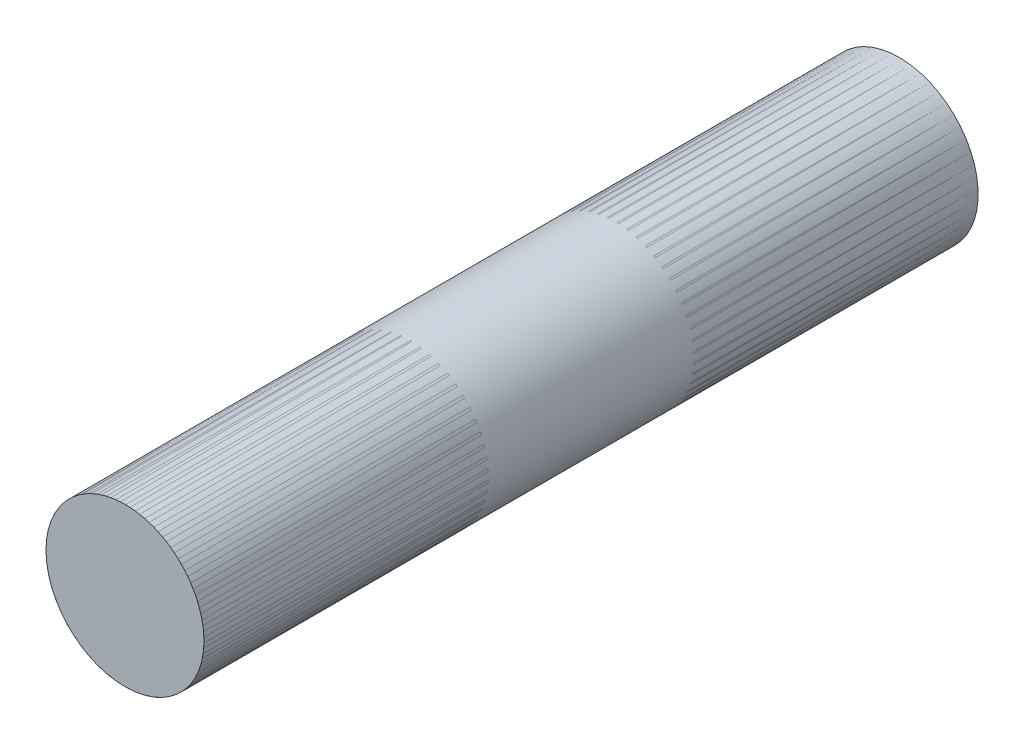
ISO-10303-21;
HEADER;
FILE_DESCRIPTION(('STEP AP214'),'2;1');
FILE_NAME('part.step','',(''),(''),'','','');
FILE_SCHEMA(('AUTOMOTIVE_DESIGN { 1 0 10303 214 1 1 1 1 }'));
ENDSEC;
DATA;
#1=APPLICATION_CONTEXT('core data for automotive mechanical design processes');
#2=APPLICATION_PROTOCOL_DEFINITION('international standard','automotive_design',2000,#1);
#3=PRODUCT_CONTEXT('',#1,'mechanical');
#4=PRODUCT('Part','Part','',(#3));
#5=PRODUCT_RELATED_PRODUCT_CATEGORY('part','',(#4));
#6=PRODUCT_DEFINITION_FORMATION('','',#4);
#7=PRODUCT_DEFINITION_CONTEXT('part definition',#1,'design');
#8=PRODUCT_DEFINITION('design','',#6,#7);
#9=PRODUCT_DEFINITION_SHAPE('','',#8);
#10=(LENGTH_UNIT() NAMED_UNIT(*) SI_UNIT(.MILLI.,.METRE.));
#11=(NAMED_UNIT(*) PLANE_ANGLE_UNIT() SI_UNIT($,.RADIAN.));
#12=(NAMED_UNIT(*) SI_UNIT($,.STERADIAN.) SOLID_ANGLE_UNIT());
#13=UNCERTAINTY_MEASURE_WITH_UNIT(LENGTH_MEASURE(1.E-05),#10,'distance_accuracy_value','');
#14=(GEOMETRIC_REPRESENTATION_CONTEXT(3) GLOBAL_UNCERTAINTY_ASSIGNED_CONTEXT((#13)) GLOBAL_UNIT_ASSIGNED_CONTEXT((#10,
#11,#12)) REPRESENTATION_CONTEXT('',''));
#15=CARTESIAN_POINT('',(0.,0.,0.));
#16=DIRECTION('',(0.,0.,1.));
#17=DIRECTION('',(1.,0.,0.));
#18=AXIS2_PLACEMENT_3D('',#15,#16,#17);
#19=CARTESIAN_POINT('',(0.,0.,39.37));
#20=DIRECTION('',(0.,0.,1.));
#21=DIRECTION('',(1.,0.,0.));
#22=AXIS2_PLACEMENT_3D('',#19,#20,#21);
#23=PLANE('',#22);
#24=CARTESIAN_POINT('',(0.,0.,39.37));
#25=DIRECTION('',(0.,0.,1.));
#26=DIRECTION('',(1.,0.,0.));
#27=AXIS2_PLACEMENT_3D('',#24,#25,#26);
#28=CIRCLE('',#27,6.35);
#29=CARTESIAN_POINT('',(6.34999999999997,0.,39.37));
#30=VERTEX_POINT('',#29);
#31=EDGE_CURVE('E11',#30,#30,#28,.F.);
#32=ORIENTED_EDGE('',*,*,#31,.F.);
#33=EDGE_LOOP('',(#32));
#34=FACE_BOUND('',#33,.T.);
#35=ADVANCED_FACE('F42',(#34),#23,.T.);
#36=CARTESIAN_POINT('',(0.,0.,-22.86));
#37=DIRECTION('',(0.,0.,-1.));
#38=DIRECTION('',(-1.,0.,0.));
#39=AXIS2_PLACEMENT_3D('',#36,#37,#38);
#40=PLANE('',#39);
#41=CARTESIAN_POINT('',(0.,0.,-22.86));
#42=DIRECTION('',(0.,0.,-1.));
#43=DIRECTION('',(-1.,0.,0.));
#44=AXIS2_PLACEMENT_3D('',#41,#42,#43);
#45=CIRCLE('',#44,6.35);
#46=CARTESIAN_POINT('',(-6.35,0.,-22.86));
#47=VERTEX_POINT('',#46);
#48=EDGE_CURVE('E48',#47,#47,#45,.T.);
#49=ORIENTED_EDGE('',*,*,#48,.T.);
#50=EDGE_LOOP('',(#49));
#51=FACE_BOUND('',#50,.T.);
#52=ADVANCED_FACE('F54',(#51),#40,.T.);
#53=CARTESIAN_POINT('',(0.,0.,57.3305122421383));
#54=DIRECTION('',(0.,0.,-1.));
#55=DIRECTION('',(-1.,0.,0.));
#56=AXIS2_PLACEMENT_3D('',#53,#54,#55);
#57=CYLINDRICAL_SURFACE('',#56,6.35);
#58=ORIENTED_EDGE('',*,*,#48,.F.);
#59=EDGE_LOOP('',(#58));
#60=FACE_BOUND('',#59,.T.);
#61=ORIENTED_EDGE('',*,*,#31,.T.);
#62=EDGE_LOOP('',(#61));
#63=FACE_BOUND('',#62,.T.);
#64=ADVANCED_FACE('F56',(#60,#63),#57,.T.);
#65=CLOSED_SHELL('',(#35,#52,#64));
#66=MANIFOLD_SOLID_BREP('B2',#65);
#67=CARTESIAN_POINT('',(1.04126776645508E-12,-5.48172618408671E-13,27.94));
#68=DIRECTION('',(0.,0.,1.));
#69=DIRECTION('',(0.0477074819120458,-0.998861349822693,0.));
#70=AXIS2_PLACEMENT_3D('',#67,#68,#69);
#71=CYLINDRICAL_SURFACE('',#70,6.35);
#72=CARTESIAN_POINT('',(1.03779831950312E-12,-5.41233724504764E-13,16.51));
#73=DIRECTION('',(0.,0.,1.));
#74=DIRECTION('',(0.0477074819120458,-0.998861349822693,0.));
#75=AXIS2_PLACEMENT_3D('',#72,#73,#74);
#76=CIRCLE('',#75,6.35);
#77=CARTESIAN_POINT('',(0.302942510142529,-6.34276957137464,16.51));
#78=VERTEX_POINT('',#77);
#79=EDGE_CURVE('E94',#78,#78,#76,.T.);
#80=ORIENTED_EDGE('',*,*,#79,.F.);
#81=EDGE_LOOP('',(#80));
#82=FACE_BOUND('',#81,.T.);
#83=CARTESIAN_POINT('',(1.04452037297253E-12,-5.62050406216485E-13,39.37));
#84=DIRECTION('',(0.,0.,1.));
#85=DIRECTION('',(0.0477074819120458,-0.998861349822693,0.));
#86=AXIS2_PLACEMENT_3D('',#83,#84,#85);
#87=CIRCLE('',#86,6.35);
#88=CARTESIAN_POINT('',(0.302942510142535,-6.34276957137466,39.37));
#89=VERTEX_POINT('',#88);
#90=EDGE_CURVE('E41',#89,#89,#87,.F.);
#91=ORIENTED_EDGE('',*,*,#90,.F.);
#92=EDGE_LOOP('',(#91));
#93=FACE_BOUND('',#92,.T.);
#94=ADVANCED_FACE('F90',(#82,#93),#71,.F.);
#95=OPEN_SHELL('',(#94));
#96=SHELL_BASED_SURFACE_MODEL('B6',(#95));
#97=CARTESIAN_POINT('',(0.,0.,-11.43));
#98=DIRECTION('',(0.,0.,-1.));
#99=DIRECTION('',(-1.,0.,0.));
#100=AXIS2_PLACEMENT_3D('',#97,#98,#99);
#101=CYLINDRICAL_SURFACE('',#100,6.35);
#102=CARTESIAN_POINT('',(0.,0.,0.));
#103=DIRECTION('',(0.,0.,-1.));
#104=DIRECTION('',(-1.,0.,0.));
#105=AXIS2_PLACEMENT_3D('',#102,#103,#104);
#106=CIRCLE('',#105,6.35);
#107=CARTESIAN_POINT('',(-6.35000000000001,0.,0.));
#108=VERTEX_POINT('',#107);
#109=EDGE_CURVE('E119',#108,#108,#106,.T.);
#110=ORIENTED_EDGE('',*,*,#109,.F.);
#111=EDGE_LOOP('',(#110));
#112=FACE_BOUND('',#111,.T.);
#113=CARTESIAN_POINT('',(0.,0.,-22.86));
#114=DIRECTION('',(0.,0.,-1.));
#115=DIRECTION('',(-1.,0.,0.));
#116=AXIS2_PLACEMENT_3D('',#113,#114,#115);
#117=CIRCLE('',#116,6.35);
#118=CARTESIAN_POINT('',(-6.35,0.,-22.86));
#119=VERTEX_POINT('',#118);
#120=EDGE_CURVE('E89',#119,#119,#117,.F.);
#121=ORIENTED_EDGE('',*,*,#120,.F.);
#122=EDGE_LOOP('',(#121));
#123=FACE_BOUND('',#122,.T.);
#124=ADVANCED_FACE('F115',(#112,#123),#101,.F.);
#125=OPEN_SHELL('',(#124));
#126=SHELL_BASED_SURFACE_MODEL('B36',(#125));
#127=ADVANCED_BREP_SHAPE_REPRESENTATION('',(#18,#66),#14);
#128=MANIFOLD_SURFACE_SHAPE_REPRESENTATION('',(#18,#96,#126),#14);
#129=SHAPE_REPRESENTATION('',(#18),#14);
#130=SHAPE_DEFINITION_REPRESENTATION(#9,#129);
#131=SHAPE_REPRESENTATION_RELATIONSHIP('','',#129,#127);
#132=SHAPE_REPRESENTATION_RELATIONSHIP('','',#129,#128);
ENDSEC;
END-ISO-10303-21;
